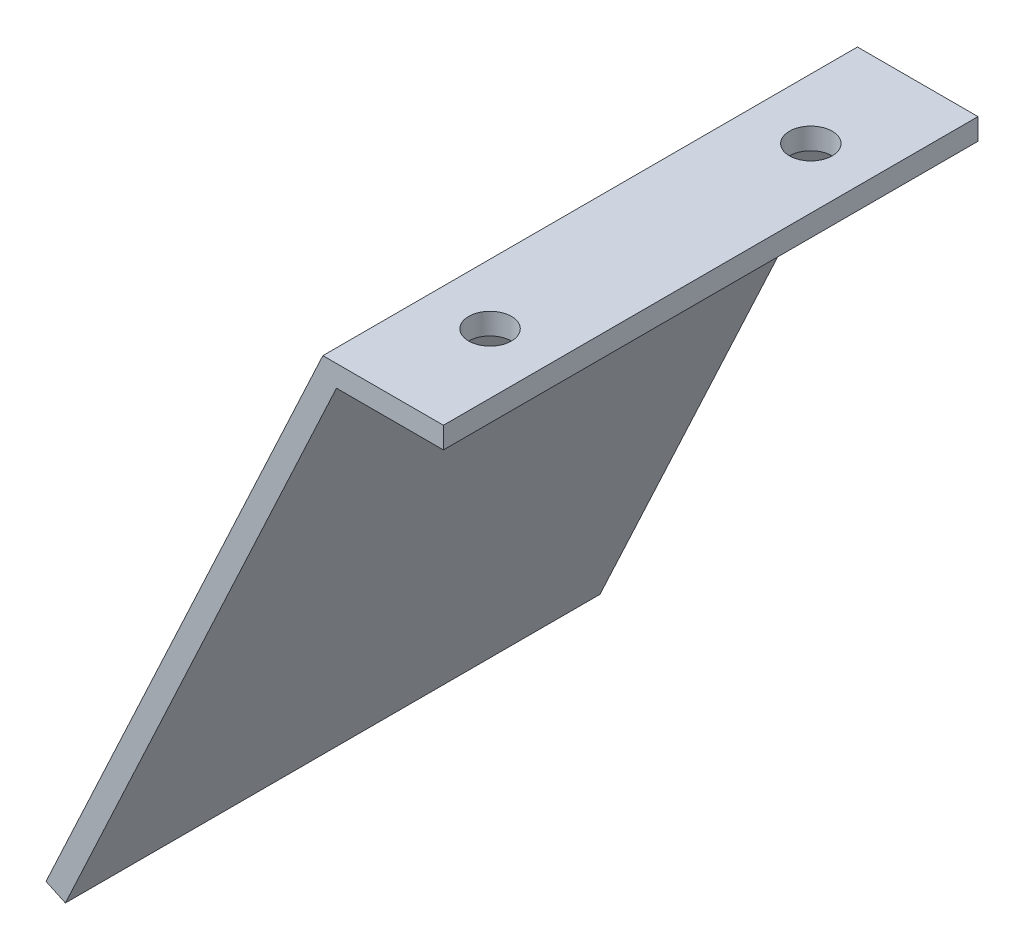
ISO-10303-21;
HEADER;
FILE_DESCRIPTION(('STEP AP214'),'2;1');
FILE_NAME('part.step','',(''),(''),'','','');
FILE_SCHEMA(('AUTOMOTIVE_DESIGN { 1 0 10303 214 1 1 1 1 }'));
ENDSEC;
DATA;
#1=APPLICATION_CONTEXT('core data for automotive mechanical design processes');
#2=APPLICATION_PROTOCOL_DEFINITION('international standard','automotive_design',2000,#1);
#3=PRODUCT_CONTEXT('',#1,'mechanical');
#4=PRODUCT('Part','Part','',(#3));
#5=PRODUCT_RELATED_PRODUCT_CATEGORY('part','',(#4));
#6=PRODUCT_DEFINITION_FORMATION('','',#4);
#7=PRODUCT_DEFINITION_CONTEXT('part definition',#1,'design');
#8=PRODUCT_DEFINITION('design','',#6,#7);
#9=PRODUCT_DEFINITION_SHAPE('','',#8);
#10=(LENGTH_UNIT() NAMED_UNIT(*) SI_UNIT(.MILLI.,.METRE.));
#11=(NAMED_UNIT(*) PLANE_ANGLE_UNIT() SI_UNIT($,.RADIAN.));
#12=(NAMED_UNIT(*) SI_UNIT($,.STERADIAN.) SOLID_ANGLE_UNIT());
#13=UNCERTAINTY_MEASURE_WITH_UNIT(LENGTH_MEASURE(1.E-05),#10,'distance_accuracy_value','');
#14=(GEOMETRIC_REPRESENTATION_CONTEXT(3) GLOBAL_UNCERTAINTY_ASSIGNED_CONTEXT((#13)) GLOBAL_UNIT_ASSIGNED_CONTEXT((#10,
#11,#12)) REPRESENTATION_CONTEXT('',''));
#15=CARTESIAN_POINT('',(0.,0.,0.));
#16=DIRECTION('',(0.,0.,1.));
#17=DIRECTION('',(1.,0.,0.));
#18=AXIS2_PLACEMENT_3D('',#15,#16,#17);
#19=CARTESIAN_POINT('',(0.,2.,50.));
#20=DIRECTION('',(-1.,0.,0.));
#21=DIRECTION('',(0.,0.,1.));
#22=AXIS2_PLACEMENT_3D('',#19,#20,#21);
#23=PLANE('',#22);
#24=DIRECTION('',(0.,1.,0.));
#25=VECTOR('',#24,1.);
#26=CARTESIAN_POINT('',(0.,2.,0.));
#27=LINE('',#26,#25);
#28=CARTESIAN_POINT('',(0.,0.,0.));
#29=VERTEX_POINT('',#28);
#30=CARTESIAN_POINT('',(0.,2.,0.));
#31=VERTEX_POINT('',#30);
#32=EDGE_CURVE('E116',#29,#31,#27,.T.);
#33=ORIENTED_EDGE('',*,*,#32,.T.);
#34=DIRECTION('',(0.,0.,-1.));
#35=VECTOR('',#34,1.);
#36=CARTESIAN_POINT('',(0.,2.,50.));
#37=LINE('',#36,#35);
#38=CARTESIAN_POINT('',(0.,2.,50.));
#39=VERTEX_POINT('',#38);
#40=EDGE_CURVE('E11',#39,#31,#37,.T.);
#41=ORIENTED_EDGE('',*,*,#40,.F.);
#42=DIRECTION('',(0.,1.,0.));
#43=VECTOR('',#42,1.);
#44=CARTESIAN_POINT('',(0.,2.,50.));
#45=LINE('',#44,#43);
#46=CARTESIAN_POINT('',(0.,0.,50.));
#47=VERTEX_POINT('',#46);
#48=EDGE_CURVE('E127',#47,#39,#45,.T.);
#49=ORIENTED_EDGE('',*,*,#48,.F.);
#50=DIRECTION('',(0.,0.,-1.));
#51=VECTOR('',#50,1.);
#52=CARTESIAN_POINT('',(0.,0.,50.));
#53=LINE('',#52,#51);
#54=EDGE_CURVE('E112',#47,#29,#53,.T.);
#55=ORIENTED_EDGE('',*,*,#54,.T.);
#56=EDGE_LOOP('',(#33,#41,#49,#55));
#57=FACE_BOUND('',#56,.T.);
#58=ADVANCED_FACE('F32',(#57),#23,.F.);
#59=CARTESIAN_POINT('',(-11.274140521615,2.,50.));
#60=DIRECTION('',(0.,-1.,0.));
#61=DIRECTION('',(0.,0.,-1.));
#62=AXIS2_PLACEMENT_3D('',#59,#60,#61);
#63=PLANE('',#62);
#64=CARTESIAN_POINT('',(-5.6370702608075,2.,10.));
#65=DIRECTION('',(0.,1.,0.));
#66=DIRECTION('',(-1.,0.,0.));
#67=AXIS2_PLACEMENT_3D('',#64,#65,#66);
#68=CIRCLE('',#67,2.);
#69=CARTESIAN_POINT('',(-7.6370702608075,2.,10.));
#70=VERTEX_POINT('',#69);
#71=EDGE_CURVE('E224',#70,#70,#68,.T.);
#72=ORIENTED_EDGE('',*,*,#71,.F.);
#73=EDGE_LOOP('',(#72));
#74=FACE_BOUND('',#73,.T.);
#75=CARTESIAN_POINT('',(-5.6370702608075,2.,40.));
#76=DIRECTION('',(0.,1.,0.));
#77=DIRECTION('',(-1.,0.,0.));
#78=AXIS2_PLACEMENT_3D('',#75,#76,#77);
#79=CIRCLE('',#78,2.);
#80=CARTESIAN_POINT('',(-7.6370702608075,2.,40.));
#81=VERTEX_POINT('',#80);
#82=EDGE_CURVE('E230',#81,#81,#79,.T.);
#83=ORIENTED_EDGE('',*,*,#82,.F.);
#84=EDGE_LOOP('',(#83));
#85=FACE_BOUND('',#84,.T.);
#86=DIRECTION('',(-1.,0.,0.));
#87=VECTOR('',#86,1.);
#88=CARTESIAN_POINT('',(-11.274140521615,2.,0.));
#89=LINE('',#88,#87);
#90=CARTESIAN_POINT('',(-11.274140521615,2.,0.));
#91=VERTEX_POINT('',#90);
#92=EDGE_CURVE('E119',#31,#91,#89,.T.);
#93=ORIENTED_EDGE('',*,*,#92,.T.);
#94=DIRECTION('',(0.,0.,-1.));
#95=VECTOR('',#94,1.);
#96=CARTESIAN_POINT('',(-11.274140521615,2.,50.));
#97=LINE('',#96,#95);
#98=CARTESIAN_POINT('',(-11.274140521615,2.,50.));
#99=VERTEX_POINT('',#98);
#100=EDGE_CURVE('E40',#99,#91,#97,.T.);
#101=ORIENTED_EDGE('',*,*,#100,.F.);
#102=DIRECTION('',(-1.,0.,0.));
#103=VECTOR('',#102,1.);
#104=CARTESIAN_POINT('',(-11.274140521615,2.,50.));
#105=LINE('',#104,#103);
#106=EDGE_CURVE('E85',#39,#99,#105,.T.);
#107=ORIENTED_EDGE('',*,*,#106,.F.);
#108=ORIENTED_EDGE('',*,*,#40,.T.);
#109=EDGE_LOOP('',(#93,#101,#107,#108));
#110=FACE_BOUND('',#109,.T.);
#111=ADVANCED_FACE('F154',(#74,#85,#110),#63,.F.);
#112=CARTESIAN_POINT('',(-37.1697112785151,-53.5332306987177,50.));
#113=DIRECTION('',(0.906307787036651,-0.422618261740697,0.));
#114=DIRECTION('',(0.422618261740697,0.906307787036651,0.));
#115=AXIS2_PLACEMENT_3D('',#112,#113,#114);
#116=PLANE('',#115);
#117=DIRECTION('',(-0.422618261740697,-0.906307787036651,0.));
#118=VECTOR('',#117,1.);
#119=CARTESIAN_POINT('',(-37.1697112785151,-53.5332306987177,0.));
#120=LINE('',#119,#118);
#121=CARTESIAN_POINT('',(-37.1697112785151,-53.5332306987177,0.));
#122=VERTEX_POINT('',#121);
#123=EDGE_CURVE('E122',#91,#122,#120,.T.);
#124=ORIENTED_EDGE('',*,*,#123,.T.);
#125=DIRECTION('',(0.,0.,-1.));
#126=VECTOR('',#125,1.);
#127=CARTESIAN_POINT('',(-37.1697112785151,-53.5332306987177,50.));
#128=LINE('',#127,#126);
#129=CARTESIAN_POINT('',(-37.1697112785151,-53.5332306987177,50.));
#130=VERTEX_POINT('',#129);
#131=EDGE_CURVE('E107',#130,#122,#128,.T.);
#132=ORIENTED_EDGE('',*,*,#131,.F.);
#133=DIRECTION('',(-0.422618261740697,-0.906307787036651,0.));
#134=VECTOR('',#133,1.);
#135=CARTESIAN_POINT('',(-37.1697112785151,-53.5332306987177,50.));
#136=LINE('',#135,#134);
#137=EDGE_CURVE('E98',#99,#130,#136,.T.);
#138=ORIENTED_EDGE('',*,*,#137,.F.);
#139=ORIENTED_EDGE('',*,*,#100,.T.);
#140=EDGE_LOOP('',(#124,#132,#138,#139));
#141=FACE_BOUND('',#140,.T.);
#142=ADVANCED_FACE('F133',(#141),#116,.F.);
#143=CARTESIAN_POINT('',(-35.3570957044418,-54.3784672221991,50.));
#144=DIRECTION('',(0.422618261740701,0.906307787036649,0.));
#145=DIRECTION('',(-0.906307787036649,0.422618261740701,0.));
#146=AXIS2_PLACEMENT_3D('',#143,#144,#145);
#147=PLANE('',#146);
#148=DIRECTION('',(0.906307787036649,-0.422618261740701,0.));
#149=VECTOR('',#148,1.);
#150=CARTESIAN_POINT('',(-35.3570957044418,-54.3784672221991,0.));
#151=LINE('',#150,#149);
#152=CARTESIAN_POINT('',(-35.3570957044418,-54.3784672221991,0.));
#153=VERTEX_POINT('',#152);
#154=EDGE_CURVE('E106',#122,#153,#151,.T.);
#155=ORIENTED_EDGE('',*,*,#154,.T.);
#156=DIRECTION('',(0.,0.,-1.));
#157=VECTOR('',#156,1.);
#158=CARTESIAN_POINT('',(-35.3570957044418,-54.3784672221991,50.));
#159=LINE('',#158,#157);
#160=CARTESIAN_POINT('',(-35.3570957044418,-54.3784672221991,50.));
#161=VERTEX_POINT('',#160);
#162=EDGE_CURVE('E103',#161,#153,#159,.T.);
#163=ORIENTED_EDGE('',*,*,#162,.F.);
#164=DIRECTION('',(0.906307787036649,-0.422618261740701,0.));
#165=VECTOR('',#164,1.);
#166=CARTESIAN_POINT('',(-35.3570957044418,-54.3784672221991,50.));
#167=LINE('',#166,#165);
#168=EDGE_CURVE('E92',#130,#161,#167,.T.);
#169=ORIENTED_EDGE('',*,*,#168,.F.);
#170=ORIENTED_EDGE('',*,*,#131,.T.);
#171=EDGE_LOOP('',(#155,#163,#169,#170));
#172=FACE_BOUND('',#171,.T.);
#173=ADVANCED_FACE('F104',(#172),#147,.F.);
#174=CARTESIAN_POINT('',(-10.,0.,50.));
#175=DIRECTION('',(-0.906307787036651,0.422618261740697,0.));
#176=DIRECTION('',(-0.422618261740697,-0.906307787036651,0.));
#177=AXIS2_PLACEMENT_3D('',#174,#175,#176);
#178=PLANE('',#177);
#179=DIRECTION('',(0.422618261740697,0.906307787036651,0.));
#180=VECTOR('',#179,1.);
#181=CARTESIAN_POINT('',(-10.,0.,0.));
#182=LINE('',#181,#180);
#183=CARTESIAN_POINT('',(-10.,0.,0.));
#184=VERTEX_POINT('',#183);
#185=EDGE_CURVE('E71',#153,#184,#182,.T.);
#186=ORIENTED_EDGE('',*,*,#185,.T.);
#187=DIRECTION('',(0.,0.,-1.));
#188=VECTOR('',#187,1.);
#189=CARTESIAN_POINT('',(-10.,0.,50.));
#190=LINE('',#189,#188);
#191=CARTESIAN_POINT('',(-10.,0.,50.));
#192=VERTEX_POINT('',#191);
#193=EDGE_CURVE('E108',#192,#184,#190,.T.);
#194=ORIENTED_EDGE('',*,*,#193,.F.);
#195=DIRECTION('',(0.422618261740697,0.906307787036651,0.));
#196=VECTOR('',#195,1.);
#197=CARTESIAN_POINT('',(-10.,0.,50.));
#198=LINE('',#197,#196);
#199=EDGE_CURVE('E96',#161,#192,#198,.T.);
#200=ORIENTED_EDGE('',*,*,#199,.F.);
#201=ORIENTED_EDGE('',*,*,#162,.T.);
#202=EDGE_LOOP('',(#186,#194,#200,#201));
#203=FACE_BOUND('',#202,.T.);
#204=ADVANCED_FACE('F110',(#203),#178,.F.);
#205=CARTESIAN_POINT('',(0.,0.,50.));
#206=DIRECTION('',(0.,1.,0.));
#207=DIRECTION('',(-1.,0.,0.));
#208=AXIS2_PLACEMENT_3D('',#205,#206,#207);
#209=PLANE('',#208);
#210=CARTESIAN_POINT('',(-5.6370702608075,0.,10.));
#211=DIRECTION('',(0.,1.,0.));
#212=DIRECTION('',(-1.,0.,0.));
#213=AXIS2_PLACEMENT_3D('',#210,#211,#212);
#214=CIRCLE('',#213,2.);
#215=CARTESIAN_POINT('',(-7.6370702608075,0.,10.));
#216=VERTEX_POINT('',#215);
#217=EDGE_CURVE('E120',#216,#216,#214,.F.);
#218=ORIENTED_EDGE('',*,*,#217,.F.);
#219=EDGE_LOOP('',(#218));
#220=FACE_BOUND('',#219,.T.);
#221=CARTESIAN_POINT('',(-5.6370702608075,0.,40.));
#222=DIRECTION('',(0.,1.,0.));
#223=DIRECTION('',(-1.,0.,0.));
#224=AXIS2_PLACEMENT_3D('',#221,#222,#223);
#225=CIRCLE('',#224,2.);
#226=CARTESIAN_POINT('',(-7.6370702608075,0.,40.));
#227=VERTEX_POINT('',#226);
#228=EDGE_CURVE('E227',#227,#227,#225,.F.);
#229=ORIENTED_EDGE('',*,*,#228,.F.);
#230=EDGE_LOOP('',(#229));
#231=FACE_BOUND('',#230,.T.);
#232=DIRECTION('',(1.,0.,0.));
#233=VECTOR('',#232,1.);
#234=CARTESIAN_POINT('',(0.,0.,0.));
#235=LINE('',#234,#233);
#236=EDGE_CURVE('E77',#184,#29,#235,.T.);
#237=ORIENTED_EDGE('',*,*,#236,.T.);
#238=ORIENTED_EDGE('',*,*,#54,.F.);
#239=DIRECTION('',(1.,0.,0.));
#240=VECTOR('',#239,1.);
#241=CARTESIAN_POINT('',(0.,0.,50.));
#242=LINE('',#241,#240);
#243=EDGE_CURVE('E48',#192,#47,#242,.T.);
#244=ORIENTED_EDGE('',*,*,#243,.F.);
#245=ORIENTED_EDGE('',*,*,#193,.T.);
#246=EDGE_LOOP('',(#237,#238,#244,#245));
#247=FACE_BOUND('',#246,.T.);
#248=ADVANCED_FACE('F140',(#220,#231,#247),#209,.F.);
#249=CARTESIAN_POINT('',(0.,0.,50.));
#250=DIRECTION('',(0.,0.,-1.));
#251=DIRECTION('',(-1.,0.,0.));
#252=AXIS2_PLACEMENT_3D('',#249,#250,#251);
#253=PLANE('',#252);
#254=ORIENTED_EDGE('',*,*,#48,.T.);
#255=ORIENTED_EDGE('',*,*,#106,.T.);
#256=ORIENTED_EDGE('',*,*,#137,.T.);
#257=ORIENTED_EDGE('',*,*,#168,.T.);
#258=ORIENTED_EDGE('',*,*,#199,.T.);
#259=ORIENTED_EDGE('',*,*,#243,.T.);
#260=EDGE_LOOP('',(#254,#255,#256,#257,#258,#259));
#261=FACE_BOUND('',#260,.T.);
#262=ADVANCED_FACE('F94',(#261),#253,.F.);
#263=CARTESIAN_POINT('',(0.,0.,0.));
#264=DIRECTION('',(0.,0.,-1.));
#265=DIRECTION('',(-1.,0.,0.));
#266=AXIS2_PLACEMENT_3D('',#263,#264,#265);
#267=PLANE('',#266);
#268=ORIENTED_EDGE('',*,*,#32,.F.);
#269=ORIENTED_EDGE('',*,*,#236,.F.);
#270=ORIENTED_EDGE('',*,*,#185,.F.);
#271=ORIENTED_EDGE('',*,*,#154,.F.);
#272=ORIENTED_EDGE('',*,*,#123,.F.);
#273=ORIENTED_EDGE('',*,*,#92,.F.);
#274=EDGE_LOOP('',(#268,#269,#270,#271,#272,#273));
#275=FACE_BOUND('',#274,.T.);
#276=ADVANCED_FACE('F136',(#275),#267,.T.);
#277=CARTESIAN_POINT('',(-5.63707026080751,-54.3794672221991,40.));
#278=DIRECTION('',(0.,1.,0.));
#279=DIRECTION('',(-1.,0.,0.));
#280=AXIS2_PLACEMENT_3D('',#277,#278,#279);
#281=CYLINDRICAL_SURFACE('',#280,2.);
#282=ORIENTED_EDGE('',*,*,#82,.T.);
#283=EDGE_LOOP('',(#282));
#284=FACE_BOUND('',#283,.T.);
#285=ORIENTED_EDGE('',*,*,#228,.T.);
#286=EDGE_LOOP('',(#285));
#287=FACE_BOUND('',#286,.T.);
#288=ADVANCED_FACE('F190',(#284,#287),#281,.F.);
#289=CARTESIAN_POINT('',(-5.63707026080752,-54.3794672221991,10.));
#290=DIRECTION('',(0.,1.,0.));
#291=DIRECTION('',(-1.,0.,0.));
#292=AXIS2_PLACEMENT_3D('',#289,#290,#291);
#293=CYLINDRICAL_SURFACE('',#292,2.);
#294=ORIENTED_EDGE('',*,*,#71,.T.);
#295=EDGE_LOOP('',(#294));
#296=FACE_BOUND('',#295,.T.);
#297=ORIENTED_EDGE('',*,*,#217,.T.);
#298=EDGE_LOOP('',(#297));
#299=FACE_BOUND('',#298,.T.);
#300=ADVANCED_FACE('F208',(#296,#299),#293,.F.);
#301=CLOSED_SHELL('',(#58,#111,#142,#173,#204,#248,#262,#276,#288,#300));
#302=MANIFOLD_SOLID_BREP('B2',#301);
#303=ADVANCED_BREP_SHAPE_REPRESENTATION('',(#18,#302),#14);
#304=SHAPE_DEFINITION_REPRESENTATION(#9,#303);
ENDSEC;
END-ISO-10303-21;
